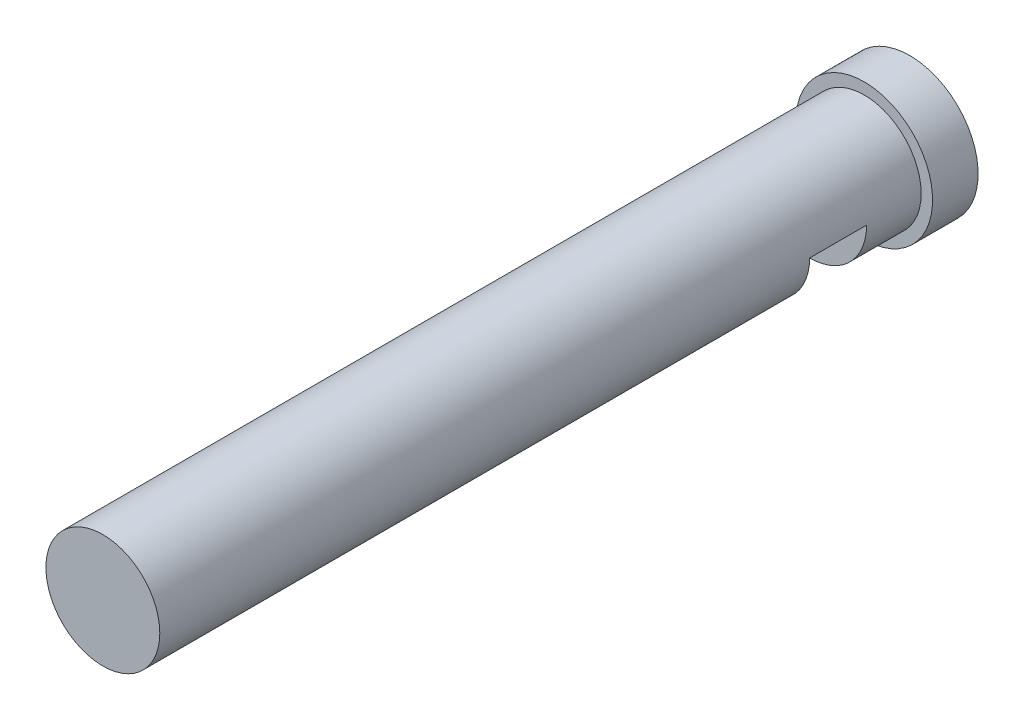
ISO-10303-21;
HEADER;
FILE_DESCRIPTION(('STEP AP214'),'2;1');
FILE_NAME('part.step','',(''),(''),'','','');
FILE_SCHEMA(('AUTOMOTIVE_DESIGN { 1 0 10303 214 1 1 1 1 }'));
ENDSEC;
DATA;
#1=APPLICATION_CONTEXT('core data for automotive mechanical design processes');
#2=APPLICATION_PROTOCOL_DEFINITION('international standard','automotive_design',2000,#1);
#3=PRODUCT_CONTEXT('',#1,'mechanical');
#4=PRODUCT('Part','Part','',(#3));
#5=PRODUCT_RELATED_PRODUCT_CATEGORY('part','',(#4));
#6=PRODUCT_DEFINITION_FORMATION('','',#4);
#7=PRODUCT_DEFINITION_CONTEXT('part definition',#1,'design');
#8=PRODUCT_DEFINITION('design','',#6,#7);
#9=PRODUCT_DEFINITION_SHAPE('','',#8);
#10=(LENGTH_UNIT() NAMED_UNIT(*) SI_UNIT(.MILLI.,.METRE.));
#11=(NAMED_UNIT(*) PLANE_ANGLE_UNIT() SI_UNIT($,.RADIAN.));
#12=(NAMED_UNIT(*) SI_UNIT($,.STERADIAN.) SOLID_ANGLE_UNIT());
#13=UNCERTAINTY_MEASURE_WITH_UNIT(LENGTH_MEASURE(1.E-05),#10,'distance_accuracy_value','');
#14=(GEOMETRIC_REPRESENTATION_CONTEXT(3) GLOBAL_UNCERTAINTY_ASSIGNED_CONTEXT((#13)) GLOBAL_UNIT_ASSIGNED_CONTEXT((#10,
#11,#12)) REPRESENTATION_CONTEXT('',''));
#15=CARTESIAN_POINT('',(0.,0.,0.));
#16=DIRECTION('',(0.,0.,1.));
#17=DIRECTION('',(1.,0.,0.));
#18=AXIS2_PLACEMENT_3D('',#15,#16,#17);
#19=CARTESIAN_POINT('',(0.,0.,6.0833));
#20=DIRECTION('',(0.,0.,-1.));
#21=DIRECTION('',(-1.,0.,0.));
#22=AXIS2_PLACEMENT_3D('',#19,#20,#21);
#23=CYLINDRICAL_SURFACE('',#22,6.35);
#24=CARTESIAN_POINT('',(0.,0.,6.0833));
#25=DIRECTION('',(0.,0.,1.));
#26=DIRECTION('',(1.,0.,0.));
#27=AXIS2_PLACEMENT_3D('',#24,#25,#26);
#28=CIRCLE('',#27,6.35);
#29=CARTESIAN_POINT('',(0.,-6.35,6.0833));
#30=VERTEX_POINT('',#29);
#31=CARTESIAN_POINT('',(6.35,0.,6.0833));
#32=VERTEX_POINT('',#31);
#33=EDGE_CURVE('E11',#30,#32,#28,.T.);
#34=ORIENTED_EDGE('',*,*,#33,.F.);
#35=DIRECTION('',(0.,0.,-1.));
#36=VECTOR('',#35,1.);
#37=CARTESIAN_POINT('',(0.,-6.35,12.4333));
#38=LINE('',#37,#36);
#39=CARTESIAN_POINT('',(0.,-6.35,12.4333));
#40=VERTEX_POINT('',#39);
#41=EDGE_CURVE('E65',#40,#30,#38,.T.);
#42=ORIENTED_EDGE('',*,*,#41,.F.);
#43=CARTESIAN_POINT('',(0.,0.,12.4333));
#44=DIRECTION('',(0.,0.,1.));
#45=DIRECTION('',(1.,0.,0.));
#46=AXIS2_PLACEMENT_3D('',#43,#44,#45);
#47=CIRCLE('',#46,6.35);
#48=CARTESIAN_POINT('',(6.35,0.,12.4333));
#49=VERTEX_POINT('',#48);
#50=EDGE_CURVE('E70',#40,#49,#47,.T.);
#51=ORIENTED_EDGE('',*,*,#50,.T.);
#52=DIRECTION('',(0.,0.,-1.));
#53=VECTOR('',#52,1.);
#54=CARTESIAN_POINT('',(6.35,0.,12.4333));
#55=LINE('',#54,#53);
#56=EDGE_CURVE('E61',#49,#32,#55,.T.);
#57=ORIENTED_EDGE('',*,*,#56,.T.);
#58=EDGE_LOOP('',(#34,#42,#51,#57));
#59=FACE_BOUND('',#58,.T.);
#60=CARTESIAN_POINT('',(0.,0.,0.));
#61=DIRECTION('',(0.,0.,1.));
#62=DIRECTION('',(1.,0.,0.));
#63=AXIS2_PLACEMENT_3D('',#60,#61,#62);
#64=CIRCLE('',#63,6.35);
#65=CARTESIAN_POINT('',(6.35,0.,0.));
#66=VERTEX_POINT('',#65);
#67=EDGE_CURVE('E38',#66,#66,#64,.T.);
#68=ORIENTED_EDGE('',*,*,#67,.T.);
#69=EDGE_LOOP('',(#68));
#70=FACE_BOUND('',#69,.T.);
#71=CARTESIAN_POINT('',(0.,0.,84.89442));
#72=DIRECTION('',(0.,0.,1.));
#73=DIRECTION('',(1.,0.,0.));
#74=AXIS2_PLACEMENT_3D('',#71,#72,#73);
#75=CIRCLE('',#74,6.35);
#76=CARTESIAN_POINT('',(6.35,0.,84.89442));
#77=VERTEX_POINT('',#76);
#78=EDGE_CURVE('E73',#77,#77,#75,.T.);
#79=ORIENTED_EDGE('',*,*,#78,.F.);
#80=EDGE_LOOP('',(#79));
#81=FACE_BOUND('',#80,.T.);
#82=ADVANCED_FACE('F35',(#59,#70,#81),#23,.T.);
#83=CARTESIAN_POINT('',(0.,0.,6.0833));
#84=DIRECTION('',(0.,0.,1.));
#85=DIRECTION('',(1.,0.,0.));
#86=AXIS2_PLACEMENT_3D('',#83,#84,#85);
#87=PLANE('',#86);
#88=DIRECTION('',(0.707106781186547,0.707106781186548,0.));
#89=VECTOR('',#88,1.);
#90=CARTESIAN_POINT('',(0.,-6.35,6.0833));
#91=LINE('',#90,#89);
#92=EDGE_CURVE('E47',#30,#32,#91,.T.);
#93=ORIENTED_EDGE('',*,*,#92,.F.);
#94=ORIENTED_EDGE('',*,*,#33,.T.);
#95=EDGE_LOOP('',(#93,#94));
#96=FACE_BOUND('',#95,.T.);
#97=ADVANCED_FACE('F104',(#96),#87,.T.);
#98=CARTESIAN_POINT('',(0.,0.,-5.08));
#99=DIRECTION('',(0.,0.,1.));
#100=DIRECTION('',(1.,0.,0.));
#101=AXIS2_PLACEMENT_3D('',#98,#99,#100);
#102=CYLINDRICAL_SURFACE('',#101,7.62);
#103=CARTESIAN_POINT('',(0.,0.,-5.08));
#104=DIRECTION('',(0.,0.,-1.));
#105=DIRECTION('',(-1.,0.,0.));
#106=AXIS2_PLACEMENT_3D('',#103,#104,#105);
#107=CIRCLE('',#106,7.62);
#108=CARTESIAN_POINT('',(-7.62,0.,-5.08));
#109=VERTEX_POINT('',#108);
#110=EDGE_CURVE('E81',#109,#109,#107,.T.);
#111=ORIENTED_EDGE('',*,*,#110,.F.);
#112=EDGE_LOOP('',(#111));
#113=FACE_BOUND('',#112,.T.);
#114=CARTESIAN_POINT('',(0.,0.,0.));
#115=DIRECTION('',(0.,0.,-1.));
#116=DIRECTION('',(-1.,0.,0.));
#117=AXIS2_PLACEMENT_3D('',#114,#115,#116);
#118=CIRCLE('',#117,7.62);
#119=CARTESIAN_POINT('',(-7.62,0.,0.));
#120=VERTEX_POINT('',#119);
#121=EDGE_CURVE('E80',#120,#120,#118,.T.);
#122=ORIENTED_EDGE('',*,*,#121,.T.);
#123=EDGE_LOOP('',(#122));
#124=FACE_BOUND('',#123,.T.);
#125=ADVANCED_FACE('F87',(#113,#124),#102,.T.);
#126=CARTESIAN_POINT('',(0.,0.,-5.08));
#127=DIRECTION('',(0.,0.,-1.));
#128=DIRECTION('',(-1.,0.,0.));
#129=AXIS2_PLACEMENT_3D('',#126,#127,#128);
#130=PLANE('',#129);
#131=ORIENTED_EDGE('',*,*,#110,.T.);
#132=EDGE_LOOP('',(#131));
#133=FACE_BOUND('',#132,.T.);
#134=ADVANCED_FACE('F91',(#133),#130,.T.);
#135=CARTESIAN_POINT('',(0.,0.,0.));
#136=DIRECTION('',(0.,0.,-1.));
#137=DIRECTION('',(-1.,0.,0.));
#138=AXIS2_PLACEMENT_3D('',#135,#136,#137);
#139=PLANE('',#138);
#140=ORIENTED_EDGE('',*,*,#67,.F.);
#141=EDGE_LOOP('',(#140));
#142=FACE_BOUND('',#141,.T.);
#143=ORIENTED_EDGE('',*,*,#121,.F.);
#144=EDGE_LOOP('',(#143));
#145=FACE_BOUND('',#144,.T.);
#146=ADVANCED_FACE('F89',(#142,#145),#139,.F.);
#147=CARTESIAN_POINT('',(0.,-6.35,12.4333));
#148=DIRECTION('',(-0.707106781186548,0.707106781186547,0.));
#149=DIRECTION('',(-0.707106781186547,-0.707106781186548,0.));
#150=AXIS2_PLACEMENT_3D('',#147,#148,#149);
#151=PLANE('',#150);
#152=ORIENTED_EDGE('',*,*,#92,.T.);
#153=ORIENTED_EDGE('',*,*,#56,.F.);
#154=DIRECTION('',(0.707106781186547,0.707106781186548,0.));
#155=VECTOR('',#154,1.);
#156=CARTESIAN_POINT('',(0.,-6.35,12.4333));
#157=LINE('',#156,#155);
#158=EDGE_CURVE('E56',#40,#49,#157,.T.);
#159=ORIENTED_EDGE('',*,*,#158,.F.);
#160=ORIENTED_EDGE('',*,*,#41,.T.);
#161=EDGE_LOOP('',(#152,#153,#159,#160));
#162=FACE_BOUND('',#161,.T.);
#163=ADVANCED_FACE('F62',(#162),#151,.F.);
#164=CARTESIAN_POINT('',(0.,0.,12.4333));
#165=DIRECTION('',(0.,0.,1.));
#166=DIRECTION('',(1.,0.,0.));
#167=AXIS2_PLACEMENT_3D('',#164,#165,#166);
#168=PLANE('',#167);
#169=ORIENTED_EDGE('',*,*,#50,.F.);
#170=ORIENTED_EDGE('',*,*,#158,.T.);
#171=EDGE_LOOP('',(#169,#170));
#172=FACE_BOUND('',#171,.T.);
#173=ADVANCED_FACE('F69',(#172),#168,.F.);
#174=CARTESIAN_POINT('',(0.,0.,84.89442));
#175=DIRECTION('',(0.,0.,1.));
#176=DIRECTION('',(1.,0.,0.));
#177=AXIS2_PLACEMENT_3D('',#174,#175,#176);
#178=PLANE('',#177);
#179=ORIENTED_EDGE('',*,*,#78,.T.);
#180=EDGE_LOOP('',(#179));
#181=FACE_BOUND('',#180,.T.);
#182=ADVANCED_FACE('F148',(#181),#178,.T.);
#183=CLOSED_SHELL('',(#82,#97,#125,#134,#146,#163,#173,#182));
#184=MANIFOLD_SOLID_BREP('B2',#183);
#185=ADVANCED_BREP_SHAPE_REPRESENTATION('',(#18,#184),#14);
#186=SHAPE_DEFINITION_REPRESENTATION(#9,#185);
ENDSEC;
END-ISO-10303-21;
